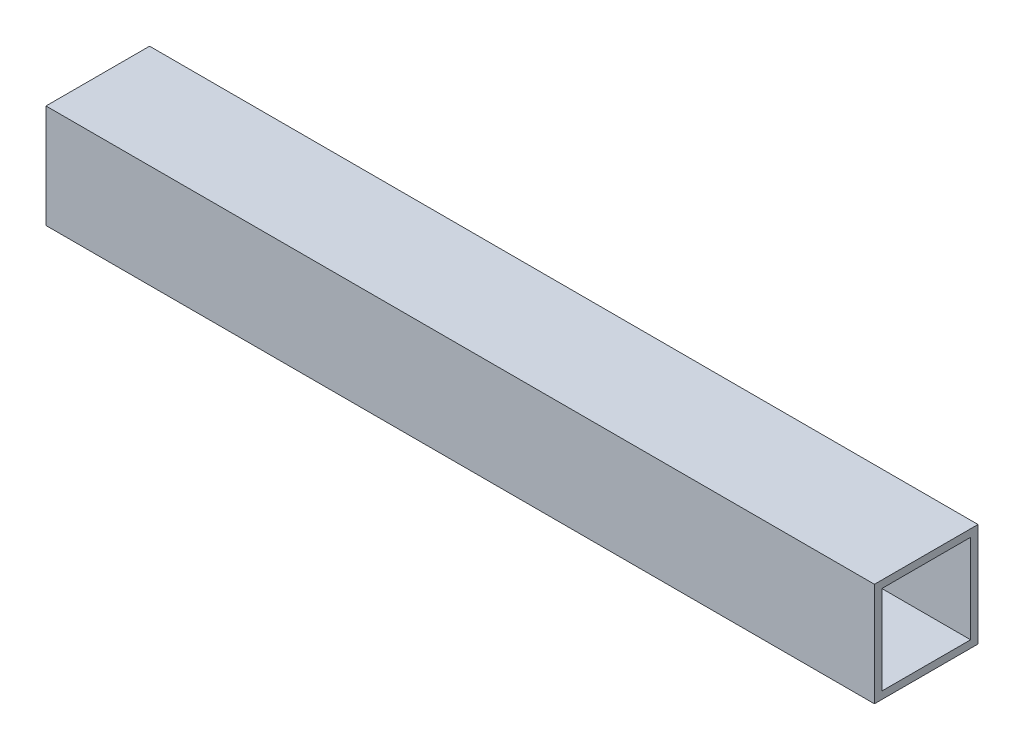
ISO-10303-21;
HEADER;
FILE_DESCRIPTION(('STEP AP214'),'2;1');
FILE_NAME('part.step','',(''),(''),'','','');
FILE_SCHEMA(('AUTOMOTIVE_DESIGN { 1 0 10303 214 1 1 1 1 }'));
ENDSEC;
DATA;
#1=APPLICATION_CONTEXT('core data for automotive mechanical design processes');
#2=APPLICATION_PROTOCOL_DEFINITION('international standard','automotive_design',2000,#1);
#3=PRODUCT_CONTEXT('',#1,'mechanical');
#4=PRODUCT('Part','Part','',(#3));
#5=PRODUCT_RELATED_PRODUCT_CATEGORY('part','',(#4));
#6=PRODUCT_DEFINITION_FORMATION('','',#4);
#7=PRODUCT_DEFINITION_CONTEXT('part definition',#1,'design');
#8=PRODUCT_DEFINITION('design','',#6,#7);
#9=PRODUCT_DEFINITION_SHAPE('','',#8);
#10=(LENGTH_UNIT() NAMED_UNIT(*) SI_UNIT(.MILLI.,.METRE.));
#11=(NAMED_UNIT(*) PLANE_ANGLE_UNIT() SI_UNIT($,.RADIAN.));
#12=(NAMED_UNIT(*) SI_UNIT($,.STERADIAN.) SOLID_ANGLE_UNIT());
#13=UNCERTAINTY_MEASURE_WITH_UNIT(LENGTH_MEASURE(1.E-05),#10,'distance_accuracy_value','');
#14=(GEOMETRIC_REPRESENTATION_CONTEXT(3) GLOBAL_UNCERTAINTY_ASSIGNED_CONTEXT((#13)) GLOBAL_UNIT_ASSIGNED_CONTEXT((#10,
#11,#12)) REPRESENTATION_CONTEXT('',''));
#15=CARTESIAN_POINT('',(0.,0.,0.));
#16=DIRECTION('',(0.,0.,1.));
#17=DIRECTION('',(1.,0.,0.));
#18=AXIS2_PLACEMENT_3D('',#15,#16,#17);
#19=CARTESIAN_POINT('',(177.8,0.,0.));
#20=DIRECTION('',(1.,0.,0.));
#21=DIRECTION('',(0.,0.,-1.));
#22=AXIS2_PLACEMENT_3D('',#19,#20,#21);
#23=PLANE('',#22);
#24=DIRECTION('',(0.,-1.,0.));
#25=VECTOR('',#24,1.);
#26=CARTESIAN_POINT('',(177.8,44.45,0.));
#27=LINE('',#26,#25);
#28=CARTESIAN_POINT('',(177.8,44.45,0.));
#29=VERTEX_POINT('',#28);
#30=CARTESIAN_POINT('',(177.8,0.,0.));
#31=VERTEX_POINT('',#30);
#32=EDGE_CURVE('E135',#29,#31,#27,.T.);
#33=ORIENTED_EDGE('',*,*,#32,.T.);
#34=DIRECTION('',(0.,0.,-1.));
#35=VECTOR('',#34,1.);
#36=CARTESIAN_POINT('',(177.8,0.,0.));
#37=LINE('',#36,#35);
#38=CARTESIAN_POINT('',(177.8,0.,-44.45));
#39=VERTEX_POINT('',#38);
#40=EDGE_CURVE('E138',#31,#39,#37,.T.);
#41=ORIENTED_EDGE('',*,*,#40,.T.);
#42=DIRECTION('',(0.,1.,0.));
#43=VECTOR('',#42,1.);
#44=CARTESIAN_POINT('',(177.8,0.,-44.45));
#45=LINE('',#44,#43);
#46=CARTESIAN_POINT('',(177.8,44.45,-44.45));
#47=VERTEX_POINT('',#46);
#48=EDGE_CURVE('E141',#39,#47,#45,.T.);
#49=ORIENTED_EDGE('',*,*,#48,.T.);
#50=DIRECTION('',(0.,0.,1.));
#51=VECTOR('',#50,1.);
#52=CARTESIAN_POINT('',(177.8,44.45,-44.45));
#53=LINE('',#52,#51);
#54=EDGE_CURVE('E143',#47,#29,#53,.T.);
#55=ORIENTED_EDGE('',*,*,#54,.T.);
#56=EDGE_LOOP('',(#33,#41,#49,#55));
#57=FACE_BOUND('',#56,.T.);
#58=DIRECTION('',(0.,0.,1.));
#59=VECTOR('',#58,1.);
#60=CARTESIAN_POINT('',(177.8,41.275,-41.275));
#61=LINE('',#60,#59);
#62=CARTESIAN_POINT('',(177.8,41.275,-41.275));
#63=VERTEX_POINT('',#62);
#64=CARTESIAN_POINT('',(177.8,41.275,-3.175));
#65=VERTEX_POINT('',#64);
#66=EDGE_CURVE('E107',#63,#65,#61,.T.);
#67=ORIENTED_EDGE('',*,*,#66,.F.);
#68=DIRECTION('',(0.,1.,0.));
#69=VECTOR('',#68,1.);
#70=CARTESIAN_POINT('',(177.8,3.175,-41.275));
#71=LINE('',#70,#69);
#72=CARTESIAN_POINT('',(177.8,3.175,-41.275));
#73=VERTEX_POINT('',#72);
#74=EDGE_CURVE('E99',#73,#63,#71,.T.);
#75=ORIENTED_EDGE('',*,*,#74,.F.);
#76=DIRECTION('',(0.,0.,-1.));
#77=VECTOR('',#76,1.);
#78=CARTESIAN_POINT('',(177.8,3.175,-3.17500000000001));
#79=LINE('',#78,#77);
#80=CARTESIAN_POINT('',(177.8,3.175,-3.17500000000001));
#81=VERTEX_POINT('',#80);
#82=EDGE_CURVE('E121',#81,#73,#79,.T.);
#83=ORIENTED_EDGE('',*,*,#82,.F.);
#84=DIRECTION('',(0.,-1.,0.));
#85=VECTOR('',#84,1.);
#86=CARTESIAN_POINT('',(177.8,41.275,-3.175));
#87=LINE('',#86,#85);
#88=EDGE_CURVE('E119',#65,#81,#87,.T.);
#89=ORIENTED_EDGE('',*,*,#88,.F.);
#90=EDGE_LOOP('',(#67,#75,#83,#89));
#91=FACE_BOUND('',#90,.T.);
#92=ADVANCED_FACE('F34',(#57,#91),#23,.T.);
#93=CARTESIAN_POINT('',(-177.8,0.,0.));
#94=DIRECTION('',(1.,0.,0.));
#95=DIRECTION('',(0.,0.,-1.));
#96=AXIS2_PLACEMENT_3D('',#93,#94,#95);
#97=PLANE('',#96);
#98=DIRECTION('',(0.,-1.,0.));
#99=VECTOR('',#98,1.);
#100=CARTESIAN_POINT('',(-177.8,44.45,0.));
#101=LINE('',#100,#99);
#102=CARTESIAN_POINT('',(-177.8,44.45,0.));
#103=VERTEX_POINT('',#102);
#104=CARTESIAN_POINT('',(-177.8,0.,0.));
#105=VERTEX_POINT('',#104);
#106=EDGE_CURVE('E115',#103,#105,#101,.T.);
#107=ORIENTED_EDGE('',*,*,#106,.F.);
#108=DIRECTION('',(0.,0.,1.));
#109=VECTOR('',#108,1.);
#110=CARTESIAN_POINT('',(-177.8,44.45,-44.45));
#111=LINE('',#110,#109);
#112=CARTESIAN_POINT('',(-177.8,44.45,-44.45));
#113=VERTEX_POINT('',#112);
#114=EDGE_CURVE('E139',#113,#103,#111,.T.);
#115=ORIENTED_EDGE('',*,*,#114,.F.);
#116=DIRECTION('',(0.,1.,0.));
#117=VECTOR('',#116,1.);
#118=CARTESIAN_POINT('',(-177.8,0.,-44.45));
#119=LINE('',#118,#117);
#120=CARTESIAN_POINT('',(-177.8,0.,-44.45));
#121=VERTEX_POINT('',#120);
#122=EDGE_CURVE('E150',#121,#113,#119,.T.);
#123=ORIENTED_EDGE('',*,*,#122,.F.);
#124=DIRECTION('',(0.,0.,-1.));
#125=VECTOR('',#124,1.);
#126=CARTESIAN_POINT('',(-177.8,0.,0.));
#127=LINE('',#126,#125);
#128=EDGE_CURVE('E148',#105,#121,#127,.T.);
#129=ORIENTED_EDGE('',*,*,#128,.F.);
#130=EDGE_LOOP('',(#107,#115,#123,#129));
#131=FACE_BOUND('',#130,.T.);
#132=DIRECTION('',(0.,1.,0.));
#133=VECTOR('',#132,1.);
#134=CARTESIAN_POINT('',(-177.8,3.175,-41.275));
#135=LINE('',#134,#133);
#136=CARTESIAN_POINT('',(-177.8,3.175,-41.275));
#137=VERTEX_POINT('',#136);
#138=CARTESIAN_POINT('',(-177.8,41.275,-41.275));
#139=VERTEX_POINT('',#138);
#140=EDGE_CURVE('E57',#137,#139,#135,.T.);
#141=ORIENTED_EDGE('',*,*,#140,.T.);
#142=DIRECTION('',(0.,0.,1.));
#143=VECTOR('',#142,1.);
#144=CARTESIAN_POINT('',(-177.8,41.275,-41.275));
#145=LINE('',#144,#143);
#146=CARTESIAN_POINT('',(-177.8,41.275,-3.175));
#147=VERTEX_POINT('',#146);
#148=EDGE_CURVE('E114',#139,#147,#145,.T.);
#149=ORIENTED_EDGE('',*,*,#148,.T.);
#150=DIRECTION('',(0.,-1.,0.));
#151=VECTOR('',#150,1.);
#152=CARTESIAN_POINT('',(-177.8,41.275,-3.175));
#153=LINE('',#152,#151);
#154=CARTESIAN_POINT('',(-177.8,3.175,-3.17500000000001));
#155=VERTEX_POINT('',#154);
#156=EDGE_CURVE('E127',#147,#155,#153,.T.);
#157=ORIENTED_EDGE('',*,*,#156,.T.);
#158=DIRECTION('',(0.,0.,-1.));
#159=VECTOR('',#158,1.);
#160=CARTESIAN_POINT('',(-177.8,3.175,-3.17500000000001));
#161=LINE('',#160,#159);
#162=EDGE_CURVE('E108',#155,#137,#161,.T.);
#163=ORIENTED_EDGE('',*,*,#162,.T.);
#164=EDGE_LOOP('',(#141,#149,#157,#163));
#165=FACE_BOUND('',#164,.T.);
#166=ADVANCED_FACE('F168',(#131,#165),#97,.F.);
#167=CARTESIAN_POINT('',(177.8,44.45,0.));
#168=DIRECTION('',(0.,0.,-1.));
#169=DIRECTION('',(0.,1.,0.));
#170=AXIS2_PLACEMENT_3D('',#167,#168,#169);
#171=PLANE('',#170);
#172=ORIENTED_EDGE('',*,*,#106,.T.);
#173=DIRECTION('',(-1.,0.,0.));
#174=VECTOR('',#173,1.);
#175=CARTESIAN_POINT('',(177.8,0.,0.));
#176=LINE('',#175,#174);
#177=EDGE_CURVE('E11',#31,#105,#176,.T.);
#178=ORIENTED_EDGE('',*,*,#177,.F.);
#179=ORIENTED_EDGE('',*,*,#32,.F.);
#180=DIRECTION('',(-1.,0.,0.));
#181=VECTOR('',#180,1.);
#182=CARTESIAN_POINT('',(177.8,44.45,0.));
#183=LINE('',#182,#181);
#184=EDGE_CURVE('E145',#29,#103,#183,.T.);
#185=ORIENTED_EDGE('',*,*,#184,.T.);
#186=EDGE_LOOP('',(#172,#178,#179,#185));
#187=FACE_BOUND('',#186,.T.);
#188=ADVANCED_FACE('F36',(#187),#171,.F.);
#189=CARTESIAN_POINT('',(177.8,0.,0.));
#190=DIRECTION('',(0.,1.,0.));
#191=DIRECTION('',(0.,0.,1.));
#192=AXIS2_PLACEMENT_3D('',#189,#190,#191);
#193=PLANE('',#192);
#194=ORIENTED_EDGE('',*,*,#128,.T.);
#195=DIRECTION('',(-1.,0.,0.));
#196=VECTOR('',#195,1.);
#197=CARTESIAN_POINT('',(177.8,0.,-44.45));
#198=LINE('',#197,#196);
#199=EDGE_CURVE('E42',#39,#121,#198,.T.);
#200=ORIENTED_EDGE('',*,*,#199,.F.);
#201=ORIENTED_EDGE('',*,*,#40,.F.);
#202=ORIENTED_EDGE('',*,*,#177,.T.);
#203=EDGE_LOOP('',(#194,#200,#201,#202));
#204=FACE_BOUND('',#203,.T.);
#205=ADVANCED_FACE('F178',(#204),#193,.F.);
#206=CARTESIAN_POINT('',(177.8,0.,-44.45));
#207=DIRECTION('',(0.,0.,1.));
#208=DIRECTION('',(0.,-1.,0.));
#209=AXIS2_PLACEMENT_3D('',#206,#207,#208);
#210=PLANE('',#209);
#211=ORIENTED_EDGE('',*,*,#122,.T.);
#212=DIRECTION('',(-1.,0.,0.));
#213=VECTOR('',#212,1.);
#214=CARTESIAN_POINT('',(177.8,44.45,-44.45));
#215=LINE('',#214,#213);
#216=EDGE_CURVE('E155',#47,#113,#215,.T.);
#217=ORIENTED_EDGE('',*,*,#216,.F.);
#218=ORIENTED_EDGE('',*,*,#48,.F.);
#219=ORIENTED_EDGE('',*,*,#199,.T.);
#220=EDGE_LOOP('',(#211,#217,#218,#219));
#221=FACE_BOUND('',#220,.T.);
#222=ADVANCED_FACE('F162',(#221),#210,.F.);
#223=CARTESIAN_POINT('',(177.8,44.45,-44.45));
#224=DIRECTION('',(0.,-1.,0.));
#225=DIRECTION('',(0.,0.,-1.));
#226=AXIS2_PLACEMENT_3D('',#223,#224,#225);
#227=PLANE('',#226);
#228=ORIENTED_EDGE('',*,*,#114,.T.);
#229=ORIENTED_EDGE('',*,*,#184,.F.);
#230=ORIENTED_EDGE('',*,*,#54,.F.);
#231=ORIENTED_EDGE('',*,*,#216,.T.);
#232=EDGE_LOOP('',(#228,#229,#230,#231));
#233=FACE_BOUND('',#232,.T.);
#234=ADVANCED_FACE('F172',(#233),#227,.F.);
#235=CARTESIAN_POINT('',(177.8,3.175,-41.275));
#236=DIRECTION('',(0.,0.,1.));
#237=DIRECTION('',(0.,-1.,0.));
#238=AXIS2_PLACEMENT_3D('',#235,#236,#237);
#239=PLANE('',#238);
#240=ORIENTED_EDGE('',*,*,#140,.F.);
#241=DIRECTION('',(-1.,0.,0.));
#242=VECTOR('',#241,1.);
#243=CARTESIAN_POINT('',(177.8,3.175,-41.275));
#244=LINE('',#243,#242);
#245=EDGE_CURVE('E103',#73,#137,#244,.T.);
#246=ORIENTED_EDGE('',*,*,#245,.F.);
#247=ORIENTED_EDGE('',*,*,#74,.T.);
#248=DIRECTION('',(-1.,0.,0.));
#249=VECTOR('',#248,1.);
#250=CARTESIAN_POINT('',(177.8,41.275,-41.275));
#251=LINE('',#250,#249);
#252=EDGE_CURVE('E102',#63,#139,#251,.T.);
#253=ORIENTED_EDGE('',*,*,#252,.T.);
#254=EDGE_LOOP('',(#240,#246,#247,#253));
#255=FACE_BOUND('',#254,.T.);
#256=ADVANCED_FACE('F101',(#255),#239,.T.);
#257=CARTESIAN_POINT('',(177.8,41.275,-41.275));
#258=DIRECTION('',(0.,-1.,0.));
#259=DIRECTION('',(0.,0.,-1.));
#260=AXIS2_PLACEMENT_3D('',#257,#258,#259);
#261=PLANE('',#260);
#262=ORIENTED_EDGE('',*,*,#148,.F.);
#263=ORIENTED_EDGE('',*,*,#252,.F.);
#264=ORIENTED_EDGE('',*,*,#66,.T.);
#265=DIRECTION('',(-1.,0.,0.));
#266=VECTOR('',#265,1.);
#267=CARTESIAN_POINT('',(177.8,41.275,-3.175));
#268=LINE('',#267,#266);
#269=EDGE_CURVE('E116',#65,#147,#268,.T.);
#270=ORIENTED_EDGE('',*,*,#269,.T.);
#271=EDGE_LOOP('',(#262,#263,#264,#270));
#272=FACE_BOUND('',#271,.T.);
#273=ADVANCED_FACE('F111',(#272),#261,.T.);
#274=CARTESIAN_POINT('',(177.8,41.275,-3.175));
#275=DIRECTION('',(0.,0.,-1.));
#276=DIRECTION('',(0.,1.,0.));
#277=AXIS2_PLACEMENT_3D('',#274,#275,#276);
#278=PLANE('',#277);
#279=ORIENTED_EDGE('',*,*,#156,.F.);
#280=ORIENTED_EDGE('',*,*,#269,.F.);
#281=ORIENTED_EDGE('',*,*,#88,.T.);
#282=DIRECTION('',(-1.,0.,0.));
#283=VECTOR('',#282,1.);
#284=CARTESIAN_POINT('',(177.8,3.175,-3.17500000000001));
#285=LINE('',#284,#283);
#286=EDGE_CURVE('E49',#81,#155,#285,.T.);
#287=ORIENTED_EDGE('',*,*,#286,.T.);
#288=EDGE_LOOP('',(#279,#280,#281,#287));
#289=FACE_BOUND('',#288,.T.);
#290=ADVANCED_FACE('F201',(#289),#278,.T.);
#291=CARTESIAN_POINT('',(177.8,3.175,-3.17500000000001));
#292=DIRECTION('',(0.,1.,0.));
#293=DIRECTION('',(0.,0.,1.));
#294=AXIS2_PLACEMENT_3D('',#291,#292,#293);
#295=PLANE('',#294);
#296=ORIENTED_EDGE('',*,*,#162,.F.);
#297=ORIENTED_EDGE('',*,*,#286,.F.);
#298=ORIENTED_EDGE('',*,*,#82,.T.);
#299=ORIENTED_EDGE('',*,*,#245,.T.);
#300=EDGE_LOOP('',(#296,#297,#298,#299));
#301=FACE_BOUND('',#300,.T.);
#302=ADVANCED_FACE('F205',(#301),#295,.T.);
#303=CLOSED_SHELL('',(#92,#166,#188,#205,#222,#234,#256,#273,#290,#302));
#304=MANIFOLD_SOLID_BREP('B2',#303);
#305=ADVANCED_BREP_SHAPE_REPRESENTATION('',(#18,#304),#14);
#306=SHAPE_DEFINITION_REPRESENTATION(#9,#305);
ENDSEC;
END-ISO-10303-21;
